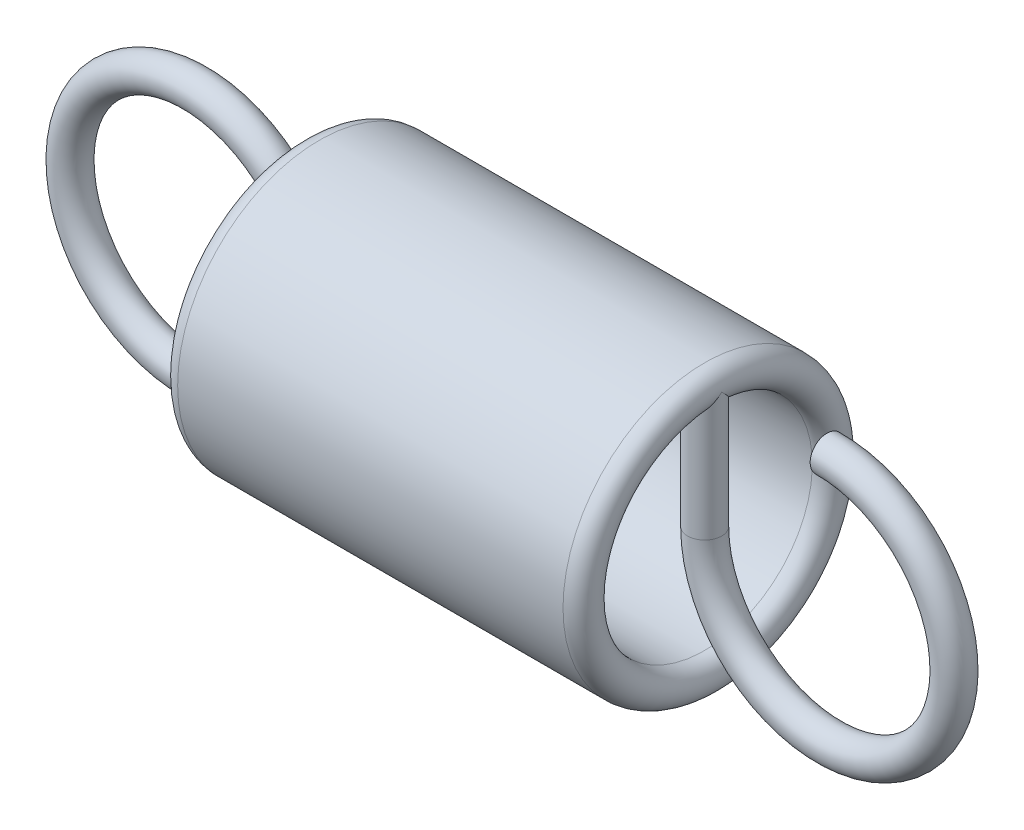
ISO-10303-21;
HEADER;
FILE_DESCRIPTION(('STEP AP214'),'2;1');
FILE_NAME('part.step','',(''),(''),'','','');
FILE_SCHEMA(('AUTOMOTIVE_DESIGN { 1 0 10303 214 1 1 1 1 }'));
ENDSEC;
DATA;
#1=APPLICATION_CONTEXT('core data for automotive mechanical design processes');
#2=APPLICATION_PROTOCOL_DEFINITION('international standard','automotive_design',2000,#1);
#3=PRODUCT_CONTEXT('',#1,'mechanical');
#4=PRODUCT('Part','Part','',(#3));
#5=PRODUCT_RELATED_PRODUCT_CATEGORY('part','',(#4));
#6=PRODUCT_DEFINITION_FORMATION('','',#4);
#7=PRODUCT_DEFINITION_CONTEXT('part definition',#1,'design');
#8=PRODUCT_DEFINITION('design','',#6,#7);
#9=PRODUCT_DEFINITION_SHAPE('','',#8);
#10=(LENGTH_UNIT() NAMED_UNIT(*) SI_UNIT(.MILLI.,.METRE.));
#11=(NAMED_UNIT(*) PLANE_ANGLE_UNIT() SI_UNIT($,.RADIAN.));
#12=(NAMED_UNIT(*) SI_UNIT($,.STERADIAN.) SOLID_ANGLE_UNIT());
#13=UNCERTAINTY_MEASURE_WITH_UNIT(LENGTH_MEASURE(1.E-05),#10,'distance_accuracy_value','');
#14=(GEOMETRIC_REPRESENTATION_CONTEXT(3) GLOBAL_UNCERTAINTY_ASSIGNED_CONTEXT((#13)) GLOBAL_UNIT_ASSIGNED_CONTEXT((#10,
#11,#12)) REPRESENTATION_CONTEXT('',''));
#15=CARTESIAN_POINT('',(0.,0.,0.));
#16=DIRECTION('',(0.,0.,1.));
#17=DIRECTION('',(1.,0.,0.));
#18=AXIS2_PLACEMENT_3D('',#15,#16,#17);
#19=CARTESIAN_POINT('',(11.2,0.,0.));
#20=DIRECTION('',(-1.,0.,0.));
#21=DIRECTION('',(0.,0.,1.));
#22=AXIS2_PLACEMENT_3D('',#19,#20,#21);
#23=CYLINDRICAL_SURFACE('',#22,1.9);
#24=CARTESIAN_POINT('',(4.1,0.,0.));
#25=DIRECTION('',(-1.,0.,0.));
#26=DIRECTION('',(0.,0.,1.));
#27=AXIS2_PLACEMENT_3D('',#24,#25,#26);
#28=CIRCLE('',#27,1.9);
#29=CARTESIAN_POINT('',(4.1,-1.87616630392937,0.3));
#30=VERTEX_POINT('',#29);
#31=CARTESIAN_POINT('',(4.10000000001832,-1.87616630392937,-0.3));
#32=VERTEX_POINT('',#31);
#33=EDGE_CURVE('E76',#30,#32,#28,.T.);
#34=ORIENTED_EDGE('',*,*,#33,.T.);
#35=CARTESIAN_POINT('',(4.1,-1.87616630392937,-0.3));
#36=CARTESIAN_POINT('',(4.11673805380121,-1.87616659480813,-0.299999316910111));
#37=CARTESIAN_POINT('',(4.13348555884791,-1.87639272018406,-0.298594447568167));
#38=CARTESIAN_POINT('',(4.16651156073859,-1.87727207910068,-0.293014018263876));
#39=CARTESIAN_POINT('',(4.18278959624595,-1.87792571875589,-0.288835823742622));
#40=CARTESIAN_POINT('',(4.21439387463695,-1.87958427074526,-0.277837520534559));
#41=CARTESIAN_POINT('',(4.22972086657228,-1.88058890239057,-0.271019522432932));
#42=CARTESIAN_POINT('',(4.2590113820471,-1.8828359090704,-0.254940256061718));
#43=CARTESIAN_POINT('',(4.27297507714533,-1.88407825413243,-0.245679295761466));
#44=CARTESIAN_POINT('',(4.29926824881745,-1.88667300767705,-0.224889427672774));
#45=CARTESIAN_POINT('',(4.3115838968627,-1.88802621040294,-0.213343127642796));
#46=CARTESIAN_POINT('',(4.33411141491453,-1.89068313421208,-0.188347909177745));
#47=CARTESIAN_POINT('',(4.34432316515544,-1.89198685247494,-0.174898882502256));
#48=CARTESIAN_POINT('',(4.36240445119291,-1.89440626919934,-0.146390909658433));
#49=CARTESIAN_POINT('',(4.37026118859852,-1.89552092647764,-0.131323750163672));
#50=CARTESIAN_POINT('',(4.38332723312506,-1.89742781305953,-0.100063067392395));
#51=CARTESIAN_POINT('',(4.38853669495337,-1.89822006120426,-0.0838696099998694));
#52=CARTESIAN_POINT('',(4.39611821356265,-1.89938725961199,-0.0509586429007868));
#53=CARTESIAN_POINT('',(4.39851346536323,-1.89976561937446,-0.0342465993865007));
#54=CARTESIAN_POINT('',(4.40047064189304,-1.90007410892386,-0.000653819787778597));
#55=CARTESIAN_POINT('',(4.4000327403118,-1.90000426618833,0.0162269058920658));
#56=CARTESIAN_POINT('',(4.39635424563587,-1.89942693267324,0.0495194609697279));
#57=CARTESIAN_POINT('',(4.39313861044812,-1.89892333925569,0.0659341251787797));
#58=CARTESIAN_POINT('',(4.38403516166589,-1.89753943064704,0.0979879196630596));
#59=CARTESIAN_POINT('',(4.37814727336312,-1.89665910492365,0.113627028242493));
#60=CARTESIAN_POINT('',(4.36384124876942,-1.89461397402977,0.143760708043224));
#61=CARTESIAN_POINT('',(4.3554127085749,-1.89344800289721,0.158250257635772));
#62=CARTESIAN_POINT('',(4.33627224329465,-1.89096134230095,0.185618769918793));
#63=CARTESIAN_POINT('',(4.32556015195681,-1.88964064157544,0.198497615234847));
#64=CARTESIAN_POINT('',(4.3020179047772,-1.88697464007409,0.222426413498461));
#65=CARTESIAN_POINT('',(4.28916594744605,-1.88562922804196,0.233454915610828));
#66=CARTESIAN_POINT('',(4.26178257516658,-1.88307941892669,0.253202185925799));
#67=CARTESIAN_POINT('',(4.24725114764275,-1.88187502289957,0.26192093683187));
#68=CARTESIAN_POINT('',(4.21689781071259,-1.87974360112244,0.276804715045431));
#69=CARTESIAN_POINT('',(4.20107471556823,-1.87881683396086,0.282967363595579));
#70=CARTESIAN_POINT('',(4.16860011588186,-1.8773500351968,0.292541499568587));
#71=CARTESIAN_POINT('',(4.15194867649538,-1.87680997322832,0.295953203011892));
#72=CARTESIAN_POINT('',(4.11848140886823,-1.87618354706712,0.299898822085886));
#73=CARTESIAN_POINT('',(4.10166926175635,-1.87609237678475,0.300463224160405));
#74=CARTESIAN_POINT('',(4.06819058821339,-1.87636127773814,0.29877927379622));
#75=CARTESIAN_POINT('',(4.05152405677664,-1.87672133340066,0.296531018431278));
#76=CARTESIAN_POINT('',(4.01890526612746,-1.87784769039498,0.289311492876814));
#77=CARTESIAN_POINT('',(4.00294952565731,-1.87861170235178,0.284355562893464));
#78=CARTESIAN_POINT('',(3.97209513185678,-1.88045798394508,0.271877386410382));
#79=CARTESIAN_POINT('',(3.95719653592211,-1.88154027084535,0.26435500069826));
#80=CARTESIAN_POINT('',(3.92874313693661,-1.88391240717815,0.24688479632725));
#81=CARTESIAN_POINT('',(3.91520053487893,-1.88520390734044,0.236917334219689));
#82=CARTESIAN_POINT('',(3.88996930228148,-1.88784404591888,0.214867064045927));
#83=CARTESIAN_POINT('',(3.87828078839401,-1.88919268792343,0.20278412298225));
#84=CARTESIAN_POINT('',(3.85697919241334,-1.89181025710778,0.176711250022556));
#85=CARTESIAN_POINT('',(3.84738637324735,-1.8930783285591,0.162704664513586));
#86=CARTESIAN_POINT('',(3.83068999375413,-1.89537838609236,0.133261078975964));
#87=CARTESIAN_POINT('',(3.82358635945912,-1.89641037918923,0.117824121469002));
#88=CARTESIAN_POINT('',(3.8121019839648,-1.89811826701041,0.0860198361511587));
#89=CARTESIAN_POINT('',(3.80771038362091,-1.89879558021439,0.069656508939222));
#90=CARTESIAN_POINT('',(3.80173967240591,-1.8997237676849,0.0364131082001044));
#91=CARTESIAN_POINT('',(3.80016035479858,-1.89997467329738,0.0195330727499269));
#92=CARTESIAN_POINT('',(3.79986450277613,-1.90002140180956,-0.0140684978112331));
#93=CARTESIAN_POINT('',(3.80111704523968,-1.89982214042518,-0.0307897619711364));
#94=CARTESIAN_POINT('',(3.8063827980348,-1.89900089253261,-0.0637806577187538));
#95=CARTESIAN_POINT('',(3.81039599661702,-1.89837890782352,-0.0800502912283014));
#96=CARTESIAN_POINT('',(3.82105775227185,-1.89678180541106,-0.111666063104883));
#97=CARTESIAN_POINT('',(3.82770394178991,-1.89580700502326,-0.12701301689476));
#98=CARTESIAN_POINT('',(3.84343965738517,-1.89361103641992,-0.156378774287424));
#99=CARTESIAN_POINT('',(3.85252927982751,-1.89238985848812,-0.170397525478495));
#100=CARTESIAN_POINT('',(3.8730046552723,-1.88982087619985,-0.196865299858035));
#101=CARTESIAN_POINT('',(3.88441315686636,-1.8884718941267,-0.209296612265905));
#102=CARTESIAN_POINT('',(3.90915460661293,-1.88580779384797,-0.232079459944929));
#103=CARTESIAN_POINT('',(3.9224880051546,-1.88449268365286,-0.242430507114024));
#104=CARTESIAN_POINT('',(3.95079968629637,-1.88203634547192,-0.260818019486575));
#105=CARTESIAN_POINT('',(3.9657877698628,-1.88089626093816,-0.268839545945716));
#106=CARTESIAN_POINT('',(3.99690995045034,-1.87893250809761,-0.28223905912167));
#107=CARTESIAN_POINT('',(4.0130428592514,-1.87810851724668,-0.287619742148408));
#108=CARTESIAN_POINT('',(4.04103657435777,-1.87705711728008,-0.294387826509332));
#109=CARTESIAN_POINT('',(4.05272599319685,-1.87672487290043,-0.296489100010135));
#110=CARTESIAN_POINT('',(4.07627536012669,-1.87627936479847,-0.299295418226343));
#111=CARTESIAN_POINT('',(4.08813530561765,-1.87616609774127,-0.300000484205205));
#112=CARTESIAN_POINT('',(4.1,-1.87616630392937,-0.3));
#113=B_SPLINE_CURVE_WITH_KNOTS('',3,(#35,#36,#37,#38,#39,#40,#41,#42,#43,#44,#45,#46,#47,#48,
#49,#50,#51,#52,#53,#54,#55,#56,#57,#58,#59,#60,#61,#62,#63,#64,#65,#66,#67,#68,#69,#70,#71,#72,
#73,#74,#75,#76,#77,#78,#79,#80,#81,#82,#83,#84,#85,#86,#87,#88,#89,#90,#91,#92,#93,#94,#95,#96,
#97,#98,#99,#100,#101,#102,#103,#104,#105,#106,#107,#108,#109,#110,#111,#112),.UNSPECIFIED.,.T.,
.F.,(4,2,2,2,2,2,2,2,2,2,2,2,2,2,2,2,2,2,2,2,2,2,2,2,2,2,2,2,2,2,2,2,2,2,2,2,2,2,4),(0.,
0.0501707854524325,0.100389299683253,0.150567745664191,0.200739868975162,0.251309615779539,
0.301882240502858,0.352724918330832,0.403564624559656,0.453982297697675,0.504396879955254,
0.554363144353046,0.604330805745416,0.654505929159544,0.704684706781863,0.755410094666613,
0.806135862396806,0.856908731142738,0.90767761251502,0.957901733292502,1.0081241207235,
1.05806488234744,1.10800835334146,1.15836701887684,1.20872885153521,1.25955796124164,
1.3103855603993,1.36100830040574,1.41162731888504,1.4616962647737,1.51176499757025,
1.56178881096536,1.61181459751042,1.66235713872182,1.71291152514867,1.76378328849728,
1.81460300299259,1.85016688091321,1.88573021721176),.UNSPECIFIED.);
#114=EDGE_CURVE('E69',#32,#30,#113,.T.);
#115=ORIENTED_EDGE('',*,*,#114,.T.);
#116=EDGE_LOOP('',(#34,#115));
#117=FACE_BOUND('',#116,.T.);
#118=CARTESIAN_POINT('',(10.9,1.87616630392937,0.3));
#119=CARTESIAN_POINT('',(10.8832619461988,1.87616659480813,0.299999316910111));
#120=CARTESIAN_POINT('',(10.8665144411521,1.87639272018406,0.298594447568168));
#121=CARTESIAN_POINT('',(10.8334884392614,1.87727207910068,0.293014018263876));
#122=CARTESIAN_POINT('',(10.8172104037541,1.87792571875589,0.288835823742623));
#123=CARTESIAN_POINT('',(10.785606125363,1.87958427074526,0.277837520534559));
#124=CARTESIAN_POINT('',(10.7702791334277,1.88058890239057,0.271019522432933));
#125=CARTESIAN_POINT('',(10.7409886179529,1.8828359090704,0.254940256061719));
#126=CARTESIAN_POINT('',(10.7270249228547,1.88407825413243,0.245679295761467));
#127=CARTESIAN_POINT('',(10.7007317511826,1.88667300767705,0.224889427672774));
#128=CARTESIAN_POINT('',(10.6884161031373,1.88802621040294,0.213343127642796));
#129=CARTESIAN_POINT('',(10.6658885850855,1.89068313421208,0.188347909177745));
#130=CARTESIAN_POINT('',(10.6556768348446,1.89198685247494,0.174898882502256));
#131=CARTESIAN_POINT('',(10.6375955488071,1.89440626919934,0.146390909658433));
#132=CARTESIAN_POINT('',(10.6297388114015,1.89552092647764,0.131323750163672));
#133=CARTESIAN_POINT('',(10.6166727668749,1.89742781305953,0.100063067392395));
#134=CARTESIAN_POINT('',(10.6114633050466,1.89822006120426,0.0838696099998702));
#135=CARTESIAN_POINT('',(10.6038817864374,1.89938725961199,0.050958642900788));
#136=CARTESIAN_POINT('',(10.6014865346368,1.89976561937446,0.0342465993865018));
#137=CARTESIAN_POINT('',(10.599529358107,1.90007410892386,0.000653819787779793));
#138=CARTESIAN_POINT('',(10.5999672596882,1.90000426618833,-0.0162269058920645));
#139=CARTESIAN_POINT('',(10.6036457543641,1.89942693267324,-0.0495194609697265));
#140=CARTESIAN_POINT('',(10.6068613895519,1.89892333925569,-0.0659341251787782));
#141=CARTESIAN_POINT('',(10.6159648383341,1.89753943064704,-0.0979879196630581));
#142=CARTESIAN_POINT('',(10.6218527266369,1.89665910492365,-0.113627028242491));
#143=CARTESIAN_POINT('',(10.6361587512306,1.89461397402977,-0.143760708043223));
#144=CARTESIAN_POINT('',(10.6445872914251,1.89344800289721,-0.158250257635771));
#145=CARTESIAN_POINT('',(10.6637277567053,1.89096134230095,-0.185618769918792));
#146=CARTESIAN_POINT('',(10.6744398480432,1.88964064157544,-0.198497615234846));
#147=CARTESIAN_POINT('',(10.6979820952228,1.88697464007409,-0.22242641349846));
#148=CARTESIAN_POINT('',(10.710834052554,1.88562922804196,-0.233454915610828));
#149=CARTESIAN_POINT('',(10.7382174248334,1.88307941892669,-0.253202185925799));
#150=CARTESIAN_POINT('',(10.7527488523572,1.88187502289957,-0.26192093683187));
#151=CARTESIAN_POINT('',(10.7831021892874,1.87974360112244,-0.276804715045431));
#152=CARTESIAN_POINT('',(10.7989252844318,1.87881683396086,-0.282967363595579));
#153=CARTESIAN_POINT('',(10.8313998841181,1.8773500351968,-0.292541499568587));
#154=CARTESIAN_POINT('',(10.8480513235046,1.87680997322832,-0.295953203011892));
#155=CARTESIAN_POINT('',(10.8815185911318,1.87618354706712,-0.299898822085886));
#156=CARTESIAN_POINT('',(10.8983307382436,1.87609237678475,-0.300463224160405));
#157=CARTESIAN_POINT('',(10.9318094117866,1.87636127773814,-0.298779273796221));
#158=CARTESIAN_POINT('',(10.9484759432234,1.87672133340066,-0.296531018431279));
#159=CARTESIAN_POINT('',(10.9810947338725,1.87784769039498,-0.289311492876815));
#160=CARTESIAN_POINT('',(10.9970504743427,1.87861170235178,-0.284355562893464));
#161=CARTESIAN_POINT('',(11.0279048681432,1.88045798394508,-0.271877386410381));
#162=CARTESIAN_POINT('',(11.0428034640779,1.88154027084535,-0.26435500069826));
#163=CARTESIAN_POINT('',(11.0712568630634,1.88391240717815,-0.24688479632725));
#164=CARTESIAN_POINT('',(11.0847994651211,1.88520390734044,-0.236917334219688));
#165=CARTESIAN_POINT('',(11.1100306977185,1.88784404591888,-0.214867064045927));
#166=CARTESIAN_POINT('',(11.121719211606,1.88919268792343,-0.202784122982251));
#167=CARTESIAN_POINT('',(11.1430208075867,1.89181025710778,-0.176711250022558));
#168=CARTESIAN_POINT('',(11.1526136267526,1.8930783285591,-0.162704664513588));
#169=CARTESIAN_POINT('',(11.1693100062459,1.89537838609236,-0.133261078975966));
#170=CARTESIAN_POINT('',(11.1764136405409,1.89641037918923,-0.117824121469004));
#171=CARTESIAN_POINT('',(11.1878980160352,1.89811826701041,-0.0860198361511604));
#172=CARTESIAN_POINT('',(11.1922896163791,1.89879558021439,-0.0696565089392236));
#173=CARTESIAN_POINT('',(11.1982603275941,1.8997237676849,-0.0364131082001057));
#174=CARTESIAN_POINT('',(11.1998396452014,1.89997467329738,-0.019533072749928));
#175=CARTESIAN_POINT('',(11.2001354972239,1.90002140180956,0.0140684978112322));
#176=CARTESIAN_POINT('',(11.1988829547603,1.89982214042518,0.0307897619711353));
#177=CARTESIAN_POINT('',(11.1936172019652,1.89900089253261,0.0637806577187526));
#178=CARTESIAN_POINT('',(11.189604003383,1.89837890782352,0.0800502912283002));
#179=CARTESIAN_POINT('',(11.1789422477282,1.89678180541106,0.111666063104882));
#180=CARTESIAN_POINT('',(11.1722960582101,1.89580700502326,0.127013016894759));
#181=CARTESIAN_POINT('',(11.1565603426148,1.89361103641992,0.156378774287423));
#182=CARTESIAN_POINT('',(11.1474707201725,1.89238985848812,0.170397525478494));
#183=CARTESIAN_POINT('',(11.1269953447277,1.88982087619985,0.196865299858034));
#184=CARTESIAN_POINT('',(11.1155868431336,1.8884718941267,0.209296612265904));
#185=CARTESIAN_POINT('',(11.0908453933871,1.88580779384797,0.232079459944928));
#186=CARTESIAN_POINT('',(11.0775119948454,1.88449268365286,0.242430507114023));
#187=CARTESIAN_POINT('',(11.0492003137036,1.88203634547192,0.260818019486574));
#188=CARTESIAN_POINT('',(11.0342122301372,1.88089626093817,0.268839545945714));
#189=CARTESIAN_POINT('',(11.0030900495497,1.87893250809761,0.282239059121669));
#190=CARTESIAN_POINT('',(10.9869571407486,1.87810851724668,0.287619742148408));
#191=CARTESIAN_POINT('',(10.9589634256422,1.87705711728008,0.294387826509332));
#192=CARTESIAN_POINT('',(10.9472740068031,1.87672487290043,0.296489100010135));
#193=CARTESIAN_POINT('',(10.9237246398733,1.87627936479847,0.299295418226343));
#194=CARTESIAN_POINT('',(10.9118646943823,1.87616609774127,0.300000484205205));
#195=CARTESIAN_POINT('',(10.9,1.87616630392937,0.3));
#196=B_SPLINE_CURVE_WITH_KNOTS('',3,(#118,#119,#120,#121,#122,#123,#124,#125,#126,#127,#128,
#129,#130,#131,#132,#133,#134,#135,#136,#137,#138,#139,#140,#141,#142,#143,#144,#145,#146,#147,
#148,#149,#150,#151,#152,#153,#154,#155,#156,#157,#158,#159,#160,#161,#162,#163,#164,#165,#166,
#167,#168,#169,#170,#171,#172,#173,#174,#175,#176,#177,#178,#179,#180,#181,#182,#183,#184,#185,
#186,#187,#188,#189,#190,#191,#192,#193,#194,#195),.UNSPECIFIED.,.T.,.F.,(4,2,2,2,2,2,2,2,2,2,2,
2,2,2,2,2,2,2,2,2,2,2,2,2,2,2,2,2,2,2,2,2,2,2,2,2,2,2,4),(0.,0.0501707854524316,
0.100389299683252,0.150567745664189,0.20073986897516,0.251309615779539,0.301882240502858,
0.352724918330832,0.403564624559655,0.453982297697674,0.504396879955253,0.554363144353045,
0.604330805745415,0.654505929159543,0.704684706781863,0.755410094666612,0.806135862396805,
0.856908731142738,0.90767761251502,0.957901733292499,1.0081241207235,1.05806488234744,
1.10800835334146,1.15836701887684,1.20872885153521,1.25955796124164,1.3103855603993,
1.36100830040574,1.41162731888504,1.4616962647737,1.51176499757024,1.56178881096536,
1.61181459751042,1.66235713872181,1.71291152514867,1.76378328849728,1.81460300299259,
1.85016688091321,1.88573021721176),.UNSPECIFIED.);
#197=CARTESIAN_POINT('',(10.9,1.87616630392937,0.3));
#198=VERTEX_POINT('',#197);
#199=CARTESIAN_POINT('',(10.9,1.87616630392937,-0.3));
#200=VERTEX_POINT('',#199);
#201=EDGE_CURVE('E111',#198,#200,#196,.T.);
#202=ORIENTED_EDGE('',*,*,#201,.F.);
#203=CARTESIAN_POINT('',(10.9,0.,0.));
#204=DIRECTION('',(-1.,0.,0.));
#205=DIRECTION('',(0.,0.,1.));
#206=AXIS2_PLACEMENT_3D('',#203,#204,#205);
#207=CIRCLE('',#206,1.9);
#208=EDGE_CURVE('E81',#200,#198,#207,.T.);
#209=ORIENTED_EDGE('',*,*,#208,.F.);
#210=EDGE_LOOP('',(#202,#209));
#211=FACE_BOUND('',#210,.T.);
#212=ADVANCED_FACE('F31',(#117,#211),#23,.F.);
#213=CARTESIAN_POINT('',(10.9,0.,0.));
#214=DIRECTION('',(-1.,0.,0.));
#215=DIRECTION('',(0.,0.,1.));
#216=AXIS2_PLACEMENT_3D('',#213,#214,#215);
#217=TOROIDAL_SURFACE('',#216,2.2,0.3);
#218=CARTESIAN_POINT('',(10.9,0.,0.));
#219=DIRECTION('',(-1.,0.,0.));
#220=DIRECTION('',(0.,0.,1.));
#221=AXIS2_PLACEMENT_3D('',#218,#219,#220);
#222=CIRCLE('',#221,2.5);
#223=CARTESIAN_POINT('',(10.9,0.,2.5));
#224=VERTEX_POINT('',#223);
#225=EDGE_CURVE('E84',#224,#224,#222,.T.);
#226=ORIENTED_EDGE('',*,*,#225,.F.);
#227=EDGE_LOOP('',(#226));
#228=FACE_BOUND('',#227,.T.);
#229=CARTESIAN_POINT('',(11.2,2.2,0.));
#230=CARTESIAN_POINT('',(11.1999999899763,2.19918354924969,0.000816455633642145));
#231=CARTESIAN_POINT('',(11.1999966577315,2.19836682021684,0.00163272984077424));
#232=CARTESIAN_POINT('',(11.199796169736,2.17374429627043,0.0262276939668799));
#233=CARTESIAN_POINT('',(11.1967835031117,2.14971536520317,0.049839744490843));
#234=CARTESIAN_POINT('',(11.1852114022744,2.10189925284044,0.096043568170859));
#235=CARTESIAN_POINT('',(11.1766377191464,2.07811285245015,0.118632560447442));
#236=CARTESIAN_POINT('',(11.1568650333029,2.03811170723763,0.155996444582582));
#237=CARTESIAN_POINT('',(11.1470451181692,2.02162018934828,0.171206408776784));
#238=CARTESIAN_POINT('',(11.124139276744,1.98975358969091,0.200257275413748));
#239=CARTESIAN_POINT('',(11.1110615934784,1.97437581472017,0.214101511931941));
#240=CARTESIAN_POINT('',(11.0860377122837,1.9500956585559,0.235732981746011));
#241=CARTESIAN_POINT('',(11.0750445543421,1.94068475893094,0.244050018526224));
#242=CARTESIAN_POINT('',(11.0512851413446,1.92315128883458,0.25944668599634));
#243=CARTESIAN_POINT('',(11.0385209293546,1.91502725665089,0.266527721567228));
#244=CARTESIAN_POINT('',(11.0143684498126,1.90227667632718,0.277585140674968));
#245=CARTESIAN_POINT('',(11.0033355351577,1.89727529090935,0.281901119220608));
#246=CARTESIAN_POINT('',(10.9803558693803,1.88868986959912,0.289288404730937));
#247=CARTESIAN_POINT('',(10.9684117759169,1.88510188665718,0.292363178471755));
#248=CARTESIAN_POINT('',(10.9470238296093,1.88034134608336,0.296436545716861));
#249=CARTESIAN_POINT('',(10.9377278085192,1.87878477259509,0.297765835112193));
#250=CARTESIAN_POINT('',(10.9188928210818,1.87668621982894,0.29955662269549));
#251=CARTESIAN_POINT('',(10.9093528557462,1.87614946769979,0.300013650111773));
#252=CARTESIAN_POINT('',(10.8998,1.87616638210298,0.299999933333326));
#253=B_SPLINE_CURVE_WITH_KNOTS('',3,(#229,#230,#231,#232,#233,#234,#235,#236,#237,#238,#239,
#240,#241,#242,#243,#244,#245,#246,#247,#248,#249,#250,#251,#252),.UNSPECIFIED.,.F.,.F.,(4,2,2,
2,2,2,2,2,2,2,2,4),(0.,0.00346411616761909,0.104401593690064,0.205598729084941,
0.278846335410706,0.351910455426024,0.401838189958104,0.451708800063341,0.49014704274456,
0.528477169131943,0.556940694022123,0.585549720747945),.UNSPECIFIED.);
#254=CARTESIAN_POINT('',(11.2,2.2,0.));
#255=VERTEX_POINT('',#254);
#256=EDGE_CURVE('E72',#255,#198,#253,.T.);
#257=ORIENTED_EDGE('',*,*,#256,.F.);
#258=CARTESIAN_POINT('',(10.8998,1.87616638210298,-0.299999933333326));
#259=CARTESIAN_POINT('',(10.9127557101679,1.87612645851423,-0.30003190294249));
#260=CARTESIAN_POINT('',(10.9256669018079,1.8771284406508,-0.299179597820181));
#261=CARTESIAN_POINT('',(10.9508754195828,1.88094811628463,-0.295918191130315));
#262=CARTESIAN_POINT('',(10.9631779249518,1.88374577710723,-0.293526264821458));
#263=CARTESIAN_POINT('',(10.9868975718905,1.89088448962426,-0.287401730303049));
#264=CARTESIAN_POINT('',(10.9983180597362,1.89521931968767,-0.283674525962162));
#265=CARTESIAN_POINT('',(11.020195637462,1.90512338708066,-0.275120396498855));
#266=CARTESIAN_POINT('',(11.0306497582756,1.91069626060783,-0.27029023073207));
#267=CARTESIAN_POINT('',(11.0555523906228,1.92585639287314,-0.257081641943563));
#268=CARTESIAN_POINT('',(11.0693373841421,1.93604608330148,-0.24814613869229));
#269=CARTESIAN_POINT('',(11.0946110905773,1.95783175214667,-0.228866976363632));
#270=CARTESIAN_POINT('',(11.1060947084696,1.96943076149515,-0.21852027624869));
#271=CARTESIAN_POINT('',(11.1316342068539,1.99899243286768,-0.191894018168398));
#272=CARTESIAN_POINT('',(11.1445079983706,2.0174624793188,-0.175046068739825));
#273=CARTESIAN_POINT('',(11.1661661055358,2.05539673201269,-0.13993323405764));
#274=CARTESIAN_POINT('',(11.1749461368135,2.07486195624216,-0.121666887575255));
#275=CARTESIAN_POINT('',(11.187714197802,2.11158008263695,-0.0867092265317298));
#276=CARTESIAN_POINT('',(11.1921867987377,2.12877979854151,-0.0701349806621466));
#277=CARTESIAN_POINT('',(11.1982517719226,2.1632065647572,-0.0365528671259854));
#278=CARTESIAN_POINT('',(11.1998505321181,2.18043346904255,-0.019546046601007));
#279=CARTESIAN_POINT('',(11.1999966626029,2.19836680908131,-0.00163273913758285));
#280=CARTESIAN_POINT('',(11.1999999951843,2.19918353825378,-0.000816464734487447));
#281=CARTESIAN_POINT('',(11.2,2.2,0.));
#282=B_SPLINE_CURVE_WITH_KNOTS('',3,(#258,#259,#260,#261,#262,#263,#264,#265,#266,#267,#268,
#269,#270,#271,#272,#273,#274,#275,#276,#277,#278,#279,#280,#281),.UNSPECIFIED.,.F.,.F.,(4,2,2,
2,2,2,2,2,2,2,2,4),(0.,0.0387265049904372,0.0770283121074198,0.115176831150555,
0.153438911539347,0.211108278340353,0.268903942396949,0.352812901410437,0.436809480260461,
0.50954716758403,0.582122973380869,0.585587089548488),.UNSPECIFIED.);
#283=EDGE_CURVE('E57',#200,#255,#282,.T.);
#284=ORIENTED_EDGE('',*,*,#283,.F.);
#285=ORIENTED_EDGE('',*,*,#208,.T.);
#286=EDGE_LOOP('',(#257,#284,#285));
#287=FACE_BOUND('',#286,.T.);
#288=ADVANCED_FACE('F96',(#228,#287),#217,.T.);
#289=CARTESIAN_POINT('',(4.1,0.,0.));
#290=DIRECTION('',(-1.,0.,0.));
#291=DIRECTION('',(0.,0.,1.));
#292=AXIS2_PLACEMENT_3D('',#289,#290,#291);
#293=TOROIDAL_SURFACE('',#292,2.2,0.3);
#294=CARTESIAN_POINT('',(4.1002,-1.87616638210298,0.299999933333326));
#295=CARTESIAN_POINT('',(4.08724428983208,-1.87612645851423,0.300031902942489));
#296=CARTESIAN_POINT('',(4.0743330981921,-1.8771284406508,0.29917959782018));
#297=CARTESIAN_POINT('',(4.04912458041723,-1.88094811628463,0.295918191130315));
#298=CARTESIAN_POINT('',(4.03682207504818,-1.88374577710723,0.293526264821457));
#299=CARTESIAN_POINT('',(4.01310242810952,-1.89088448962426,0.287401730303049));
#300=CARTESIAN_POINT('',(4.00168194026381,-1.89521931968767,0.283674525962162));
#301=CARTESIAN_POINT('',(3.97980436253803,-1.90512338708066,0.275120396498855));
#302=CARTESIAN_POINT('',(3.96935024172439,-1.91069626060783,0.27029023073207));
#303=CARTESIAN_POINT('',(3.9444476093772,-1.92585639287314,0.257081641943564));
#304=CARTESIAN_POINT('',(3.93066261585787,-1.93604608330147,0.248146138692291));
#305=CARTESIAN_POINT('',(3.90538890942268,-1.95783175214667,0.228866976363633));
#306=CARTESIAN_POINT('',(3.8939052915304,-1.96943076149515,0.21852027624869));
#307=CARTESIAN_POINT('',(3.86836579314613,-1.99899243286768,0.191894018168398));
#308=CARTESIAN_POINT('',(3.85549200162943,-2.0174624793188,0.175046068739826));
#309=CARTESIAN_POINT('',(3.83383389446421,-2.05539673201269,0.13993323405764));
#310=CARTESIAN_POINT('',(3.82505386318646,-2.07486195624216,0.121666887575255));
#311=CARTESIAN_POINT('',(3.81228580219798,-2.11158008263695,0.0867092265317296));
#312=CARTESIAN_POINT('',(3.80781320126226,-2.12877979854151,0.0701349806621465));
#313=CARTESIAN_POINT('',(3.80174822807743,-2.1632065647572,0.036552867125985));
#314=CARTESIAN_POINT('',(3.80014946788192,-2.18043346904255,0.0195460466010061));
#315=CARTESIAN_POINT('',(3.80000333739705,-2.19836680908131,0.00163273913758271));
#316=CARTESIAN_POINT('',(3.80000000481571,-2.19918353825378,0.000816464734487377));
#317=CARTESIAN_POINT('',(3.8,-2.2,0.));
#318=B_SPLINE_CURVE_WITH_KNOTS('',3,(#294,#295,#296,#297,#298,#299,#300,#301,#302,#303,#304,
#305,#306,#307,#308,#309,#310,#311,#312,#313,#314,#315,#316,#317),.UNSPECIFIED.,.F.,.F.,(4,2,2,
2,2,2,2,2,2,2,2,4),(0.,0.0387265049904372,0.077028312107419,0.115176831150554,0.153438911539344,
0.211108278340349,0.268903942396948,0.352812901410436,0.436809480260459,0.50954716758403,
0.582122973380868,0.585587089548487),.UNSPECIFIED.);
#319=CARTESIAN_POINT('',(3.79999999999997,-2.2,0.));
#320=VERTEX_POINT('',#319);
#321=EDGE_CURVE('E44',#30,#320,#318,.T.);
#322=ORIENTED_EDGE('',*,*,#321,.T.);
#323=CARTESIAN_POINT('',(3.8,-2.2,0.));
#324=CARTESIAN_POINT('',(3.80000001002366,-2.19918354924969,-0.000816455633642146));
#325=CARTESIAN_POINT('',(3.80000334226855,-2.19836682021684,-0.00163272984077424));
#326=CARTESIAN_POINT('',(3.80020383026399,-2.17374429627043,-0.0262276939668797));
#327=CARTESIAN_POINT('',(3.80321649688832,-2.14971536520317,-0.0498397444908425));
#328=CARTESIAN_POINT('',(3.81478859772564,-2.10189925284044,-0.0960435681708584));
#329=CARTESIAN_POINT('',(3.82336228085355,-2.07811285245015,-0.118632560447441));
#330=CARTESIAN_POINT('',(3.8431349666971,-2.03811170723763,-0.155996444582582));
#331=CARTESIAN_POINT('',(3.85295488183077,-2.02162018934828,-0.171206408776784));
#332=CARTESIAN_POINT('',(3.875860723256,-1.98975358969091,-0.200257275413748));
#333=CARTESIAN_POINT('',(3.88893840652158,-1.97437581472017,-0.214101511931941));
#334=CARTESIAN_POINT('',(3.91396228771633,-1.9500956585559,-0.235732981746011));
#335=CARTESIAN_POINT('',(3.9249554456579,-1.94068475893094,-0.244050018526224));
#336=CARTESIAN_POINT('',(3.94871485865537,-1.92315128883458,-0.259446685996339));
#337=CARTESIAN_POINT('',(3.96147907064536,-1.91502725665089,-0.266527721567228));
#338=CARTESIAN_POINT('',(3.98563155018741,-1.90227667632718,-0.277585140674967));
#339=CARTESIAN_POINT('',(3.99666446484234,-1.89727529090936,-0.281901119220608));
#340=CARTESIAN_POINT('',(4.01964413061967,-1.88868986959912,-0.289288404730937));
#341=CARTESIAN_POINT('',(4.03158822408313,-1.88510188665718,-0.292363178471755));
#342=CARTESIAN_POINT('',(4.05297617039067,-1.88034134608336,-0.296436545716861));
#343=CARTESIAN_POINT('',(4.06227219148079,-1.87878477259509,-0.297765835112193));
#344=CARTESIAN_POINT('',(4.08110717891823,-1.87668621982894,-0.29955662269549));
#345=CARTESIAN_POINT('',(4.09064714425377,-1.87614946769979,-0.300013650111773));
#346=CARTESIAN_POINT('',(4.1002,-1.87616638210298,-0.299999933333326));
#347=B_SPLINE_CURVE_WITH_KNOTS('',3,(#323,#324,#325,#326,#327,#328,#329,#330,#331,#332,#333,
#334,#335,#336,#337,#338,#339,#340,#341,#342,#343,#344,#345,#346),.UNSPECIFIED.,.F.,.F.,(4,2,2,
2,2,2,2,2,2,2,2,4),(0.,0.00346411616761909,0.104401593690063,0.205598729084941,
0.278846335410706,0.351910455426024,0.401838189958103,0.45170880006334,0.49014704274456,
0.528477169131943,0.556940694022124,0.585549720747945),.UNSPECIFIED.);
#348=EDGE_CURVE('E11',#320,#32,#347,.T.);
#349=ORIENTED_EDGE('',*,*,#348,.T.);
#350=ORIENTED_EDGE('',*,*,#33,.F.);
#351=EDGE_LOOP('',(#322,#349,#350));
#352=FACE_BOUND('',#351,.T.);
#353=CARTESIAN_POINT('',(4.1,0.,0.));
#354=DIRECTION('',(-1.,0.,0.));
#355=DIRECTION('',(0.,0.,1.));
#356=AXIS2_PLACEMENT_3D('',#353,#354,#355);
#357=CIRCLE('',#356,2.5);
#358=CARTESIAN_POINT('',(4.1,0.,2.5));
#359=VERTEX_POINT('',#358);
#360=EDGE_CURVE('E117',#359,#359,#357,.T.);
#361=ORIENTED_EDGE('',*,*,#360,.T.);
#362=EDGE_LOOP('',(#361));
#363=FACE_BOUND('',#362,.T.);
#364=ADVANCED_FACE('F33',(#352,#363),#293,.T.);
#365=CARTESIAN_POINT('',(11.2,0.,0.));
#366=DIRECTION('',(-1.,0.,0.));
#367=DIRECTION('',(0.,0.,1.));
#368=AXIS2_PLACEMENT_3D('',#365,#366,#367);
#369=CYLINDRICAL_SURFACE('',#368,2.5);
#370=ORIENTED_EDGE('',*,*,#360,.F.);
#371=EDGE_LOOP('',(#370));
#372=FACE_BOUND('',#371,.T.);
#373=ORIENTED_EDGE('',*,*,#225,.T.);
#374=EDGE_LOOP('',(#373));
#375=FACE_BOUND('',#374,.T.);
#376=ADVANCED_FACE('F104',(#372,#375),#369,.T.);
#377=CARTESIAN_POINT('',(10.9,0.,0.));
#378=DIRECTION('',(0.,1.,0.));
#379=DIRECTION('',(0.,0.,1.));
#380=AXIS2_PLACEMENT_3D('',#377,#378,#379);
#381=CYLINDRICAL_SURFACE('',#380,0.3);
#382=CARTESIAN_POINT('',(10.9,0.,0.));
#383=DIRECTION('',(0.,1.,0.));
#384=DIRECTION('',(0.,0.,1.));
#385=AXIS2_PLACEMENT_3D('',#382,#383,#384);
#386=CIRCLE('',#385,0.3);
#387=CARTESIAN_POINT('',(10.6,0.,0.));
#388=VERTEX_POINT('',#387);
#389=EDGE_CURVE('E118',#388,#388,#386,.T.);
#390=ORIENTED_EDGE('',*,*,#389,.T.);
#391=EDGE_LOOP('',(#390));
#392=FACE_BOUND('',#391,.T.);
#393=ORIENTED_EDGE('',*,*,#256,.T.);
#394=ORIENTED_EDGE('',*,*,#201,.T.);
#395=ORIENTED_EDGE('',*,*,#283,.T.);
#396=EDGE_LOOP('',(#393,#394,#395));
#397=FACE_BOUND('',#396,.T.);
#398=ADVANCED_FACE('F99',(#392,#397),#381,.T.);
#399=CARTESIAN_POINT('',(13.1,0.,0.));
#400=DIRECTION('',(0.,0.,-1.));
#401=DIRECTION('',(-1.,0.,0.));
#402=AXIS2_PLACEMENT_3D('',#399,#400,#401);
#403=TOROIDAL_SURFACE('',#402,2.2,0.3);
#404=CARTESIAN_POINT('',(13.061604705838,2.19966492934406,0.));
#405=DIRECTION('',(0.999847695156392,0.0174524064372503,0.));
#406=DIRECTION('',(0.,0.,1.));
#407=AXIS2_PLACEMENT_3D('',#404,#405,#406);
#408=CIRCLE('',#407,0.3);
#409=CARTESIAN_POINT('',(13.0563689839069,2.49961923789098,0.));
#410=VERTEX_POINT('',#409);
#411=EDGE_CURVE('E77',#410,#410,#408,.T.);
#412=CARTESIAN_POINT('',(13.1,0.,0.));
#413=DIRECTION('',(0.,0.,-1.));
#414=DIRECTION('',(-1.,0.,0.));
#415=AXIS2_PLACEMENT_3D('',#412,#413,#414);
#416=CIRCLE('',#415,2.5);
#417=EDGE_CURVE('',#410,#388,#416,.T.);
#418=ORIENTED_EDGE('',*,*,#411,.T.);
#419=ORIENTED_EDGE('',*,*,#389,.F.);
#420=ORIENTED_EDGE('',*,*,#417,.T.);
#421=ORIENTED_EDGE('',*,*,#417,.F.);
#422=EDGE_LOOP('',(#418,#420,#419,#421));
#423=FACE_BOUND('',#422,.T.);
#424=ADVANCED_FACE('F103',(#423),#403,.T.);
#425=CARTESIAN_POINT('',(13.061604705838,2.19966492934406,0.));
#426=DIRECTION('',(0.999847695156392,0.0174524064372503,0.));
#427=DIRECTION('',(0.,0.,1.));
#428=AXIS2_PLACEMENT_3D('',#425,#426,#427);
#429=PLANE('',#428);
#430=ORIENTED_EDGE('',*,*,#411,.F.);
#431=EDGE_LOOP('',(#430));
#432=FACE_BOUND('',#431,.T.);
#433=ADVANCED_FACE('F106',(#432),#429,.F.);
#434=CARTESIAN_POINT('',(4.1,-2.2,0.));
#435=DIRECTION('',(0.,-1.,0.));
#436=DIRECTION('',(0.,0.,-1.));
#437=AXIS2_PLACEMENT_3D('',#434,#435,#436);
#438=CYLINDRICAL_SURFACE('',#437,0.3);
#439=CARTESIAN_POINT('',(4.1,0.,0.));
#440=DIRECTION('',(0.,-1.,0.));
#441=DIRECTION('',(0.,0.,-1.));
#442=AXIS2_PLACEMENT_3D('',#439,#440,#441);
#443=CIRCLE('',#442,0.3);
#444=CARTESIAN_POINT('',(4.4,0.,0.));
#445=VERTEX_POINT('',#444);
#446=EDGE_CURVE('E78',#445,#445,#443,.T.);
#447=ORIENTED_EDGE('',*,*,#446,.T.);
#448=EDGE_LOOP('',(#447));
#449=FACE_BOUND('',#448,.T.);
#450=ORIENTED_EDGE('',*,*,#114,.F.);
#451=ORIENTED_EDGE('',*,*,#348,.F.);
#452=ORIENTED_EDGE('',*,*,#321,.F.);
#453=EDGE_LOOP('',(#450,#451,#452));
#454=FACE_BOUND('',#453,.T.);
#455=ADVANCED_FACE('F68',(#449,#454),#438,.T.);
#456=CARTESIAN_POINT('',(1.9,0.,0.));
#457=DIRECTION('',(0.,0.,-1.));
#458=DIRECTION('',(-1.,0.,0.));
#459=AXIS2_PLACEMENT_3D('',#456,#457,#458);
#460=TOROIDAL_SURFACE('',#459,2.2,0.3);
#461=CARTESIAN_POINT('',(1.93839529416195,-2.19966492934406,0.));
#462=DIRECTION('',(0.999847695156392,0.0174524064372503,0.));
#463=DIRECTION('',(0.,0.,1.));
#464=AXIS2_PLACEMENT_3D('',#461,#462,#463);
#465=CIRCLE('',#464,0.3);
#466=CARTESIAN_POINT('',(1.94363101609313,-2.49961923789098,0.));
#467=VERTEX_POINT('',#466);
#468=EDGE_CURVE('E219',#467,#467,#465,.T.);
#469=CARTESIAN_POINT('',(1.9,0.,0.));
#470=DIRECTION('',(0.,0.,-1.));
#471=DIRECTION('',(-1.,0.,0.));
#472=AXIS2_PLACEMENT_3D('',#469,#470,#471);
#473=CIRCLE('',#472,2.5);
#474=EDGE_CURVE('',#467,#445,#473,.T.);
#475=ORIENTED_EDGE('',*,*,#468,.F.);
#476=ORIENTED_EDGE('',*,*,#446,.F.);
#477=ORIENTED_EDGE('',*,*,#474,.T.);
#478=ORIENTED_EDGE('',*,*,#474,.F.);
#479=EDGE_LOOP('',(#475,#477,#476,#478));
#480=FACE_BOUND('',#479,.T.);
#481=ADVANCED_FACE('F130',(#480),#460,.T.);
#482=CARTESIAN_POINT('',(1.93839529416195,-2.19966492934406,0.));
#483=DIRECTION('',(0.999847695156392,0.0174524064372503,0.));
#484=DIRECTION('',(0.,0.,1.));
#485=AXIS2_PLACEMENT_3D('',#482,#483,#484);
#486=PLANE('',#485);
#487=ORIENTED_EDGE('',*,*,#468,.T.);
#488=EDGE_LOOP('',(#487));
#489=FACE_BOUND('',#488,.T.);
#490=ADVANCED_FACE('F132',(#489),#486,.T.);
#491=CLOSED_SHELL('',(#212,#288,#364,#376,#398,#424,#433,#455,#481,#490));
#492=MANIFOLD_SOLID_BREP('B2',#491);
#493=ADVANCED_BREP_SHAPE_REPRESENTATION('',(#18,#492),#14);
#494=SHAPE_DEFINITION_REPRESENTATION(#9,#493);
ENDSEC;
END-ISO-10303-21;
